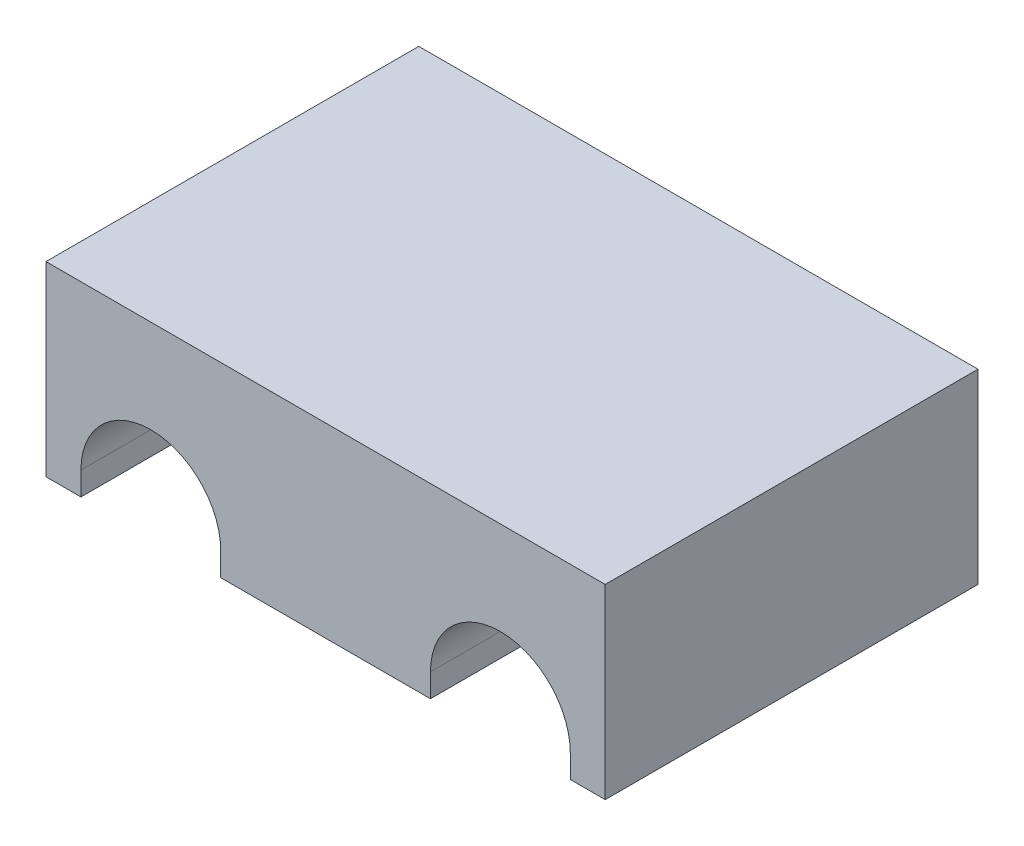
ISO-10303-21;
HEADER;
FILE_DESCRIPTION(('STEP AP214'),'2;1');
FILE_NAME('part.step','',(''),(''),'','','');
FILE_SCHEMA(('AUTOMOTIVE_DESIGN { 1 0 10303 214 1 1 1 1 }'));
ENDSEC;
DATA;
#1=APPLICATION_CONTEXT('core data for automotive mechanical design processes');
#2=APPLICATION_PROTOCOL_DEFINITION('international standard','automotive_design',2000,#1);
#3=PRODUCT_CONTEXT('',#1,'mechanical');
#4=PRODUCT('Part','Part','',(#3));
#5=PRODUCT_RELATED_PRODUCT_CATEGORY('part','',(#4));
#6=PRODUCT_DEFINITION_FORMATION('','',#4);
#7=PRODUCT_DEFINITION_CONTEXT('part definition',#1,'design');
#8=PRODUCT_DEFINITION('design','',#6,#7);
#9=PRODUCT_DEFINITION_SHAPE('','',#8);
#10=(LENGTH_UNIT() NAMED_UNIT(*) SI_UNIT(.MILLI.,.METRE.));
#11=(NAMED_UNIT(*) PLANE_ANGLE_UNIT() SI_UNIT($,.RADIAN.));
#12=(NAMED_UNIT(*) SI_UNIT($,.STERADIAN.) SOLID_ANGLE_UNIT());
#13=UNCERTAINTY_MEASURE_WITH_UNIT(LENGTH_MEASURE(1.E-05),#10,'distance_accuracy_value','');
#14=(GEOMETRIC_REPRESENTATION_CONTEXT(3) GLOBAL_UNCERTAINTY_ASSIGNED_CONTEXT((#13)) GLOBAL_UNIT_ASSIGNED_CONTEXT((#10,
#11,#12)) REPRESENTATION_CONTEXT('',''));
#15=CARTESIAN_POINT('',(0.,0.,0.));
#16=DIRECTION('',(0.,0.,1.));
#17=DIRECTION('',(1.,0.,0.));
#18=AXIS2_PLACEMENT_3D('',#15,#16,#17);
#19=CARTESIAN_POINT('',(0.,0.,50.8));
#20=DIRECTION('',(0.,0.,-1.));
#21=DIRECTION('',(-1.,0.,0.));
#22=AXIS2_PLACEMENT_3D('',#19,#20,#21);
#23=PLANE('',#22);
#24=DIRECTION('',(-1.,0.,0.));
#25=VECTOR('',#24,1.);
#26=CARTESIAN_POINT('',(1.59250000000002,0.,50.8));
#27=LINE('',#26,#25);
#28=CARTESIAN_POINT('',(6.355,0.,50.8));
#29=VERTEX_POINT('',#28);
#30=CARTESIAN_POINT('',(1.59250000000002,0.,50.8));
#31=VERTEX_POINT('',#30);
#32=EDGE_CURVE('E170',#29,#31,#27,.T.);
#33=ORIENTED_EDGE('',*,*,#32,.F.);
#34=DIRECTION('',(0.,-1.,0.));
#35=VECTOR('',#34,1.);
#36=CARTESIAN_POINT('',(6.355,0.,50.8));
#37=LINE('',#36,#35);
#38=CARTESIAN_POINT('',(6.355,3.175,50.8));
#39=VERTEX_POINT('',#38);
#40=EDGE_CURVE('E139',#39,#29,#37,.T.);
#41=ORIENTED_EDGE('',*,*,#40,.F.);
#42=CARTESIAN_POINT('',(15.88,3.175,50.8));
#43=DIRECTION('',(0.,0.,1.));
#44=DIRECTION('',(1.,0.,0.));
#45=AXIS2_PLACEMENT_3D('',#42,#43,#44);
#46=CIRCLE('',#45,9.525);
#47=CARTESIAN_POINT('',(25.405,3.175,50.8));
#48=VERTEX_POINT('',#47);
#49=EDGE_CURVE('E221',#48,#39,#46,.T.);
#50=ORIENTED_EDGE('',*,*,#49,.F.);
#51=DIRECTION('',(0.,1.,0.));
#52=VECTOR('',#51,1.);
#53=CARTESIAN_POINT('',(25.405,0.,50.8));
#54=LINE('',#53,#52);
#55=CARTESIAN_POINT('',(25.405,0.,50.8));
#56=VERTEX_POINT('',#55);
#57=EDGE_CURVE('E199',#56,#48,#54,.T.);
#58=ORIENTED_EDGE('',*,*,#57,.F.);
#59=CARTESIAN_POINT('',(53.98,0.,50.8));
#60=VERTEX_POINT('',#59);
#61=EDGE_CURVE('E148',#60,#56,#27,.T.);
#62=ORIENTED_EDGE('',*,*,#61,.F.);
#63=DIRECTION('',(0.,-1.,0.));
#64=VECTOR('',#63,1.);
#65=CARTESIAN_POINT('',(53.98,0.,50.8));
#66=LINE('',#65,#64);
#67=CARTESIAN_POINT('',(53.98,3.175,50.8));
#68=VERTEX_POINT('',#67);
#69=EDGE_CURVE('E197',#68,#60,#66,.T.);
#70=ORIENTED_EDGE('',*,*,#69,.F.);
#71=CARTESIAN_POINT('',(63.505,3.175,50.8));
#72=DIRECTION('',(0.,0.,1.));
#73=DIRECTION('',(-1.,0.,0.));
#74=AXIS2_PLACEMENT_3D('',#71,#72,#73);
#75=CIRCLE('',#74,9.525);
#76=CARTESIAN_POINT('',(73.03,3.175,50.8));
#77=VERTEX_POINT('',#76);
#78=EDGE_CURVE('E211',#77,#68,#75,.T.);
#79=ORIENTED_EDGE('',*,*,#78,.F.);
#80=DIRECTION('',(0.,1.,0.));
#81=VECTOR('',#80,1.);
#82=CARTESIAN_POINT('',(73.03,0.,50.8));
#83=LINE('',#82,#81);
#84=CARTESIAN_POINT('',(73.03,0.,50.8));
#85=VERTEX_POINT('',#84);
#86=EDGE_CURVE('E207',#85,#77,#83,.T.);
#87=ORIENTED_EDGE('',*,*,#86,.F.);
#88=CARTESIAN_POINT('',(77.7925,0.,50.8));
#89=VERTEX_POINT('',#88);
#90=EDGE_CURVE('E163',#89,#85,#27,.T.);
#91=ORIENTED_EDGE('',*,*,#90,.F.);
#92=DIRECTION('',(0.,1.,0.));
#93=VECTOR('',#92,1.);
#94=CARTESIAN_POINT('',(77.7925,-25.4,50.8));
#95=LINE('',#94,#93);
#96=CARTESIAN_POINT('',(77.7925,25.4,50.8));
#97=VERTEX_POINT('',#96);
#98=EDGE_CURVE('E177',#89,#97,#95,.T.);
#99=ORIENTED_EDGE('',*,*,#98,.T.);
#100=DIRECTION('',(-1.,0.,0.));
#101=VECTOR('',#100,1.);
#102=CARTESIAN_POINT('',(1.59250000000002,25.4,50.8));
#103=LINE('',#102,#101);
#104=CARTESIAN_POINT('',(1.59250000000002,25.4,50.8));
#105=VERTEX_POINT('',#104);
#106=EDGE_CURVE('E50',#97,#105,#103,.T.);
#107=ORIENTED_EDGE('',*,*,#106,.T.);
#108=DIRECTION('',(0.,-1.,0.));
#109=VECTOR('',#108,1.);
#110=CARTESIAN_POINT('',(1.59250000000002,-25.4,50.8));
#111=LINE('',#110,#109);
#112=EDGE_CURVE('E181',#105,#31,#111,.T.);
#113=ORIENTED_EDGE('',*,*,#112,.T.);
#114=EDGE_LOOP('',(#33,#41,#50,#58,#62,#70,#79,#87,#91,#99,#107,#113));
#115=FACE_BOUND('',#114,.T.);
#116=ADVANCED_FACE('F33',(#115),#23,.F.);
#117=CARTESIAN_POINT('',(0.,0.,0.));
#118=DIRECTION('',(0.,0.,-1.));
#119=DIRECTION('',(-1.,0.,0.));
#120=AXIS2_PLACEMENT_3D('',#117,#118,#119);
#121=PLANE('',#120);
#122=DIRECTION('',(0.,-1.,0.));
#123=VECTOR('',#122,1.);
#124=CARTESIAN_POINT('',(6.355,0.,0.));
#125=LINE('',#124,#123);
#126=CARTESIAN_POINT('',(6.355,3.175,0.));
#127=VERTEX_POINT('',#126);
#128=CARTESIAN_POINT('',(6.355,0.,0.));
#129=VERTEX_POINT('',#128);
#130=EDGE_CURVE('E218',#127,#129,#125,.T.);
#131=ORIENTED_EDGE('',*,*,#130,.T.);
#132=DIRECTION('',(-1.,0.,0.));
#133=VECTOR('',#132,1.);
#134=CARTESIAN_POINT('',(1.59250000000002,0.,0.));
#135=LINE('',#134,#133);
#136=CARTESIAN_POINT('',(1.59250000000002,0.,0.));
#137=VERTEX_POINT('',#136);
#138=EDGE_CURVE('E158',#129,#137,#135,.T.);
#139=ORIENTED_EDGE('',*,*,#138,.T.);
#140=DIRECTION('',(0.,-1.,0.));
#141=VECTOR('',#140,1.);
#142=CARTESIAN_POINT('',(1.59250000000002,-25.4,0.));
#143=LINE('',#142,#141);
#144=CARTESIAN_POINT('',(1.59250000000002,25.4,0.));
#145=VERTEX_POINT('',#144);
#146=EDGE_CURVE('E179',#145,#137,#143,.T.);
#147=ORIENTED_EDGE('',*,*,#146,.F.);
#148=DIRECTION('',(-1.,0.,0.));
#149=VECTOR('',#148,1.);
#150=CARTESIAN_POINT('',(1.59250000000002,25.4,0.));
#151=LINE('',#150,#149);
#152=CARTESIAN_POINT('',(77.7925,25.4,0.));
#153=VERTEX_POINT('',#152);
#154=EDGE_CURVE('E185',#153,#145,#151,.T.);
#155=ORIENTED_EDGE('',*,*,#154,.F.);
#156=DIRECTION('',(0.,1.,0.));
#157=VECTOR('',#156,1.);
#158=CARTESIAN_POINT('',(77.7925,-25.4,0.));
#159=LINE('',#158,#157);
#160=CARTESIAN_POINT('',(77.7925,0.,0.));
#161=VERTEX_POINT('',#160);
#162=EDGE_CURVE('E61',#161,#153,#159,.T.);
#163=ORIENTED_EDGE('',*,*,#162,.F.);
#164=CARTESIAN_POINT('',(73.03,0.,0.));
#165=VERTEX_POINT('',#164);
#166=EDGE_CURVE('E157',#161,#165,#135,.T.);
#167=ORIENTED_EDGE('',*,*,#166,.T.);
#168=DIRECTION('',(0.,1.,0.));
#169=VECTOR('',#168,1.);
#170=CARTESIAN_POINT('',(73.03,0.,0.));
#171=LINE('',#170,#169);
#172=CARTESIAN_POINT('',(73.03,3.175,0.));
#173=VERTEX_POINT('',#172);
#174=EDGE_CURVE('E70',#165,#173,#171,.T.);
#175=ORIENTED_EDGE('',*,*,#174,.T.);
#176=CARTESIAN_POINT('',(63.505,3.175,0.));
#177=DIRECTION('',(0.,0.,1.));
#178=DIRECTION('',(-1.,0.,0.));
#179=AXIS2_PLACEMENT_3D('',#176,#177,#178);
#180=CIRCLE('',#179,9.525);
#181=CARTESIAN_POINT('',(53.98,3.175,0.));
#182=VERTEX_POINT('',#181);
#183=EDGE_CURVE('E209',#173,#182,#180,.T.);
#184=ORIENTED_EDGE('',*,*,#183,.T.);
#185=DIRECTION('',(0.,-1.,0.));
#186=VECTOR('',#185,1.);
#187=CARTESIAN_POINT('',(53.98,0.,0.));
#188=LINE('',#187,#186);
#189=CARTESIAN_POINT('',(53.98,0.,0.));
#190=VERTEX_POINT('',#189);
#191=EDGE_CURVE('E156',#182,#190,#188,.T.);
#192=ORIENTED_EDGE('',*,*,#191,.T.);
#193=CARTESIAN_POINT('',(25.405,0.,0.));
#194=VERTEX_POINT('',#193);
#195=EDGE_CURVE('E146',#190,#194,#135,.T.);
#196=ORIENTED_EDGE('',*,*,#195,.T.);
#197=DIRECTION('',(0.,1.,0.));
#198=VECTOR('',#197,1.);
#199=CARTESIAN_POINT('',(25.405,0.,0.));
#200=LINE('',#199,#198);
#201=CARTESIAN_POINT('',(25.405,3.175,0.));
#202=VERTEX_POINT('',#201);
#203=EDGE_CURVE('E127',#194,#202,#200,.T.);
#204=ORIENTED_EDGE('',*,*,#203,.T.);
#205=CARTESIAN_POINT('',(15.88,3.175,0.));
#206=DIRECTION('',(0.,0.,1.));
#207=DIRECTION('',(1.,0.,0.));
#208=AXIS2_PLACEMENT_3D('',#205,#206,#207);
#209=CIRCLE('',#208,9.525);
#210=EDGE_CURVE('E138',#202,#127,#209,.T.);
#211=ORIENTED_EDGE('',*,*,#210,.T.);
#212=EDGE_LOOP('',(#131,#139,#147,#155,#163,#167,#175,#184,#192,#196,#204,#211));
#213=FACE_BOUND('',#212,.T.);
#214=ADVANCED_FACE('F153',(#213),#121,.T.);
#215=CARTESIAN_POINT('',(77.7925,-25.4,50.8));
#216=DIRECTION('',(-1.,0.,0.));
#217=DIRECTION('',(0.,0.,1.));
#218=AXIS2_PLACEMENT_3D('',#215,#216,#217);
#219=PLANE('',#218);
#220=ORIENTED_EDGE('',*,*,#98,.F.);
#221=DIRECTION('',(0.,0.,1.));
#222=VECTOR('',#221,1.);
#223=CARTESIAN_POINT('',(77.7925,0.,0.));
#224=LINE('',#223,#222);
#225=EDGE_CURVE('E161',#161,#89,#224,.T.);
#226=ORIENTED_EDGE('',*,*,#225,.F.);
#227=ORIENTED_EDGE('',*,*,#162,.T.);
#228=DIRECTION('',(0.,0.,-1.));
#229=VECTOR('',#228,1.);
#230=CARTESIAN_POINT('',(77.7925,25.4,50.8));
#231=LINE('',#230,#229);
#232=EDGE_CURVE('E191',#97,#153,#231,.T.);
#233=ORIENTED_EDGE('',*,*,#232,.F.);
#234=EDGE_LOOP('',(#220,#226,#227,#233));
#235=FACE_BOUND('',#234,.T.);
#236=ADVANCED_FACE('F35',(#235),#219,.F.);
#237=CARTESIAN_POINT('',(1.59250000000002,25.4,50.8));
#238=DIRECTION('',(0.,-1.,0.));
#239=DIRECTION('',(1.,0.,0.));
#240=AXIS2_PLACEMENT_3D('',#237,#238,#239);
#241=PLANE('',#240);
#242=ORIENTED_EDGE('',*,*,#154,.T.);
#243=DIRECTION('',(0.,0.,-1.));
#244=VECTOR('',#243,1.);
#245=CARTESIAN_POINT('',(1.59250000000002,25.4,50.8));
#246=LINE('',#245,#244);
#247=EDGE_CURVE('E183',#105,#145,#246,.T.);
#248=ORIENTED_EDGE('',*,*,#247,.F.);
#249=ORIENTED_EDGE('',*,*,#106,.F.);
#250=ORIENTED_EDGE('',*,*,#232,.T.);
#251=EDGE_LOOP('',(#242,#248,#249,#250));
#252=FACE_BOUND('',#251,.T.);
#253=ADVANCED_FACE('F239',(#252),#241,.F.);
#254=CARTESIAN_POINT('',(1.59250000000002,-25.4,50.8));
#255=DIRECTION('',(1.,0.,0.));
#256=DIRECTION('',(0.,0.,-1.));
#257=AXIS2_PLACEMENT_3D('',#254,#255,#256);
#258=PLANE('',#257);
#259=ORIENTED_EDGE('',*,*,#146,.T.);
#260=DIRECTION('',(0.,0.,1.));
#261=VECTOR('',#260,1.);
#262=CARTESIAN_POINT('',(1.59250000000002,0.,0.));
#263=LINE('',#262,#261);
#264=EDGE_CURVE('E171',#137,#31,#263,.T.);
#265=ORIENTED_EDGE('',*,*,#264,.T.);
#266=ORIENTED_EDGE('',*,*,#112,.F.);
#267=ORIENTED_EDGE('',*,*,#247,.T.);
#268=EDGE_LOOP('',(#259,#265,#266,#267));
#269=FACE_BOUND('',#268,.T.);
#270=ADVANCED_FACE('F236',(#269),#258,.F.);
#271=CARTESIAN_POINT('',(1.59250000000002,0.,0.));
#272=DIRECTION('',(0.,1.,0.));
#273=DIRECTION('',(-1.,0.,0.));
#274=AXIS2_PLACEMENT_3D('',#271,#272,#273);
#275=PLANE('',#274);
#276=DIRECTION('',(0.,0.,-1.));
#277=VECTOR('',#276,1.);
#278=CARTESIAN_POINT('',(25.405,0.,50.8));
#279=LINE('',#278,#277);
#280=EDGE_CURVE('E131',#56,#194,#279,.T.);
#281=ORIENTED_EDGE('',*,*,#280,.T.);
#282=ORIENTED_EDGE('',*,*,#195,.F.);
#283=DIRECTION('',(0.,0.,-1.));
#284=VECTOR('',#283,1.);
#285=CARTESIAN_POINT('',(53.98,0.,50.8));
#286=LINE('',#285,#284);
#287=EDGE_CURVE('E42',#190,#60,#286,.F.);
#288=ORIENTED_EDGE('',*,*,#287,.T.);
#289=ORIENTED_EDGE('',*,*,#61,.T.);
#290=EDGE_LOOP('',(#281,#282,#288,#289));
#291=FACE_BOUND('',#290,.T.);
#292=ADVANCED_FACE('F144',(#291),#275,.F.);
#293=DIRECTION('',(0.,0.,-1.));
#294=VECTOR('',#293,1.);
#295=CARTESIAN_POINT('',(73.03,0.,50.8));
#296=LINE('',#295,#294);
#297=EDGE_CURVE('E11',#85,#165,#296,.T.);
#298=ORIENTED_EDGE('',*,*,#297,.T.);
#299=ORIENTED_EDGE('',*,*,#166,.F.);
#300=ORIENTED_EDGE('',*,*,#225,.T.);
#301=ORIENTED_EDGE('',*,*,#90,.T.);
#302=EDGE_LOOP('',(#298,#299,#300,#301));
#303=FACE_BOUND('',#302,.T.);
#304=ADVANCED_FACE('F244',(#303),#275,.F.);
#305=DIRECTION('',(0.,0.,-1.));
#306=VECTOR('',#305,1.);
#307=CARTESIAN_POINT('',(6.355,0.,50.8));
#308=LINE('',#307,#306);
#309=EDGE_CURVE('E149',#129,#29,#308,.F.);
#310=ORIENTED_EDGE('',*,*,#309,.T.);
#311=ORIENTED_EDGE('',*,*,#32,.T.);
#312=ORIENTED_EDGE('',*,*,#264,.F.);
#313=ORIENTED_EDGE('',*,*,#138,.F.);
#314=EDGE_LOOP('',(#310,#311,#312,#313));
#315=FACE_BOUND('',#314,.T.);
#316=ADVANCED_FACE('F233',(#315),#275,.F.);
#317=CARTESIAN_POINT('',(63.505,3.175,0.));
#318=DIRECTION('',(0.,0.,1.));
#319=DIRECTION('',(1.,0.,0.));
#320=AXIS2_PLACEMENT_3D('',#317,#318,#319);
#321=CYLINDRICAL_SURFACE('',#320,9.525);
#322=ORIENTED_EDGE('',*,*,#78,.T.);
#323=DIRECTION('',(0.,0.,1.));
#324=VECTOR('',#323,1.);
#325=CARTESIAN_POINT('',(53.98,3.175,0.));
#326=LINE('',#325,#324);
#327=EDGE_CURVE('E166',#182,#68,#326,.T.);
#328=ORIENTED_EDGE('',*,*,#327,.F.);
#329=ORIENTED_EDGE('',*,*,#183,.F.);
#330=DIRECTION('',(0.,0.,1.));
#331=VECTOR('',#330,1.);
#332=CARTESIAN_POINT('',(73.03,3.175,0.));
#333=LINE('',#332,#331);
#334=EDGE_CURVE('E200',#173,#77,#333,.T.);
#335=ORIENTED_EDGE('',*,*,#334,.T.);
#336=EDGE_LOOP('',(#322,#328,#329,#335));
#337=FACE_BOUND('',#336,.T.);
#338=ADVANCED_FACE('F245',(#337),#321,.F.);
#339=CARTESIAN_POINT('',(73.03,0.,0.));
#340=DIRECTION('',(1.,0.,0.));
#341=DIRECTION('',(0.,0.,-1.));
#342=AXIS2_PLACEMENT_3D('',#339,#340,#341);
#343=PLANE('',#342);
#344=ORIENTED_EDGE('',*,*,#86,.T.);
#345=ORIENTED_EDGE('',*,*,#334,.F.);
#346=ORIENTED_EDGE('',*,*,#174,.F.);
#347=ORIENTED_EDGE('',*,*,#297,.F.);
#348=EDGE_LOOP('',(#344,#345,#346,#347));
#349=FACE_BOUND('',#348,.T.);
#350=ADVANCED_FACE('F248',(#349),#343,.F.);
#351=CARTESIAN_POINT('',(53.98,0.,0.));
#352=DIRECTION('',(-1.,0.,0.));
#353=DIRECTION('',(0.,0.,1.));
#354=AXIS2_PLACEMENT_3D('',#351,#352,#353);
#355=PLANE('',#354);
#356=ORIENTED_EDGE('',*,*,#69,.T.);
#357=ORIENTED_EDGE('',*,*,#287,.F.);
#358=ORIENTED_EDGE('',*,*,#191,.F.);
#359=ORIENTED_EDGE('',*,*,#327,.T.);
#360=EDGE_LOOP('',(#356,#357,#358,#359));
#361=FACE_BOUND('',#360,.T.);
#362=ADVANCED_FACE('F246',(#361),#355,.F.);
#363=CARTESIAN_POINT('',(6.355,0.,0.));
#364=DIRECTION('',(-1.,0.,0.));
#365=DIRECTION('',(0.,0.,1.));
#366=AXIS2_PLACEMENT_3D('',#363,#364,#365);
#367=PLANE('',#366);
#368=ORIENTED_EDGE('',*,*,#40,.T.);
#369=ORIENTED_EDGE('',*,*,#309,.F.);
#370=ORIENTED_EDGE('',*,*,#130,.F.);
#371=DIRECTION('',(0.,0.,1.));
#372=VECTOR('',#371,1.);
#373=CARTESIAN_POINT('',(6.355,3.175,0.));
#374=LINE('',#373,#372);
#375=EDGE_CURVE('E213',#127,#39,#374,.T.);
#376=ORIENTED_EDGE('',*,*,#375,.T.);
#377=EDGE_LOOP('',(#368,#369,#370,#376));
#378=FACE_BOUND('',#377,.T.);
#379=ADVANCED_FACE('F232',(#378),#367,.F.);
#380=CARTESIAN_POINT('',(15.88,3.175,0.));
#381=DIRECTION('',(0.,0.,1.));
#382=DIRECTION('',(1.,0.,0.));
#383=AXIS2_PLACEMENT_3D('',#380,#381,#382);
#384=CYLINDRICAL_SURFACE('',#383,9.525);
#385=ORIENTED_EDGE('',*,*,#49,.T.);
#386=ORIENTED_EDGE('',*,*,#375,.F.);
#387=ORIENTED_EDGE('',*,*,#210,.F.);
#388=DIRECTION('',(0.,0.,1.));
#389=VECTOR('',#388,1.);
#390=CARTESIAN_POINT('',(25.405,3.175,0.));
#391=LINE('',#390,#389);
#392=EDGE_CURVE('E133',#202,#48,#391,.T.);
#393=ORIENTED_EDGE('',*,*,#392,.T.);
#394=EDGE_LOOP('',(#385,#386,#387,#393));
#395=FACE_BOUND('',#394,.T.);
#396=ADVANCED_FACE('F229',(#395),#384,.F.);
#397=CARTESIAN_POINT('',(25.405,0.,0.));
#398=DIRECTION('',(1.,0.,0.));
#399=DIRECTION('',(0.,0.,-1.));
#400=AXIS2_PLACEMENT_3D('',#397,#398,#399);
#401=PLANE('',#400);
#402=ORIENTED_EDGE('',*,*,#57,.T.);
#403=ORIENTED_EDGE('',*,*,#392,.F.);
#404=ORIENTED_EDGE('',*,*,#203,.F.);
#405=ORIENTED_EDGE('',*,*,#280,.F.);
#406=EDGE_LOOP('',(#402,#403,#404,#405));
#407=FACE_BOUND('',#406,.T.);
#408=ADVANCED_FACE('F130',(#407),#401,.F.);
#409=CLOSED_SHELL('',(#116,#214,#236,#253,#270,#292,#304,#316,#338,#350,#362,#379,#396,#408));
#410=MANIFOLD_SOLID_BREP('B2',#409);
#411=ADVANCED_BREP_SHAPE_REPRESENTATION('',(#18,#410),#14);
#412=SHAPE_DEFINITION_REPRESENTATION(#9,#411);
ENDSEC;
END-ISO-10303-21;
